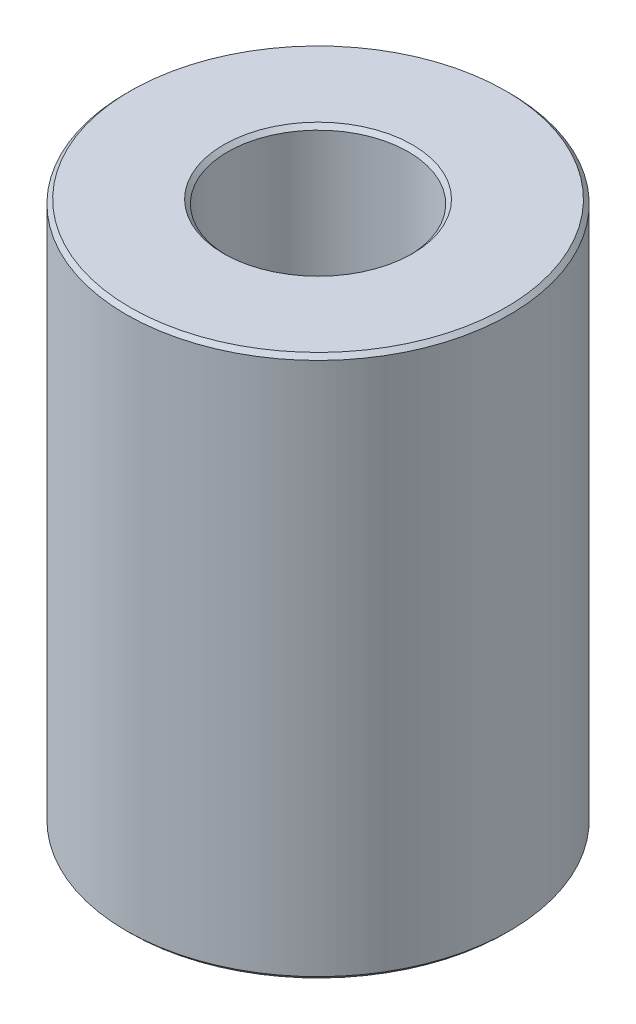
ISO-10303-21;
HEADER;
FILE_DESCRIPTION(('STEP AP214'),'2;1');
FILE_NAME('part.step','',(''),(''),'','','');
FILE_SCHEMA(('AUTOMOTIVE_DESIGN { 1 0 10303 214 1 1 1 1 }'));
ENDSEC;
DATA;
#1=APPLICATION_CONTEXT('core data for automotive mechanical design processes');
#2=APPLICATION_PROTOCOL_DEFINITION('international standard','automotive_design',2000,#1);
#3=PRODUCT_CONTEXT('',#1,'mechanical');
#4=PRODUCT('Part','Part','',(#3));
#5=PRODUCT_RELATED_PRODUCT_CATEGORY('part','',(#4));
#6=PRODUCT_DEFINITION_FORMATION('','',#4);
#7=PRODUCT_DEFINITION_CONTEXT('part definition',#1,'design');
#8=PRODUCT_DEFINITION('design','',#6,#7);
#9=PRODUCT_DEFINITION_SHAPE('','',#8);
#10=(LENGTH_UNIT() NAMED_UNIT(*) SI_UNIT(.MILLI.,.METRE.));
#11=(NAMED_UNIT(*) PLANE_ANGLE_UNIT() SI_UNIT($,.RADIAN.));
#12=(NAMED_UNIT(*) SI_UNIT($,.STERADIAN.) SOLID_ANGLE_UNIT());
#13=UNCERTAINTY_MEASURE_WITH_UNIT(LENGTH_MEASURE(1.E-05),#10,'distance_accuracy_value','');
#14=(GEOMETRIC_REPRESENTATION_CONTEXT(3) GLOBAL_UNCERTAINTY_ASSIGNED_CONTEXT((#13)) GLOBAL_UNIT_ASSIGNED_CONTEXT((#10,
#11,#12)) REPRESENTATION_CONTEXT('',''));
#15=CARTESIAN_POINT('',(0.,0.,0.));
#16=DIRECTION('',(0.,0.,1.));
#17=DIRECTION('',(1.,0.,0.));
#18=AXIS2_PLACEMENT_3D('',#15,#16,#17);
#19=CARTESIAN_POINT('',(0.,35.3197142230565,0.));
#20=DIRECTION('',(0.,-1.,0.));
#21=DIRECTION('',(0.,0.,-1.));
#22=AXIS2_PLACEMENT_3D('',#19,#20,#21);
#23=CYLINDRICAL_SURFACE('',#22,12.5);
#24=CARTESIAN_POINT('',(0.,0.265261535173894,0.));
#25=DIRECTION('',(0.,1.,0.));
#26=DIRECTION('',(0.,0.,1.));
#27=AXIS2_PLACEMENT_3D('',#24,#25,#26);
#28=CIRCLE('',#27,12.5);
#29=CARTESIAN_POINT('',(0.,0.265261535173894,12.5));
#30=VERTEX_POINT('',#29);
#31=EDGE_CURVE('E10',#30,#30,#28,.T.);
#32=ORIENTED_EDGE('',*,*,#31,.T.);
#33=EDGE_LOOP('',(#32));
#34=FACE_BOUND('',#33,.T.);
#35=CARTESIAN_POINT('',(0.,35.0544526878826,0.));
#36=DIRECTION('',(0.,1.,0.));
#37=DIRECTION('',(0.,0.,1.));
#38=AXIS2_PLACEMENT_3D('',#35,#36,#37);
#39=CIRCLE('',#38,12.5);
#40=CARTESIAN_POINT('',(0.,35.0544526878826,12.5));
#41=VERTEX_POINT('',#40);
#42=EDGE_CURVE('E50',#41,#41,#39,.F.);
#43=ORIENTED_EDGE('',*,*,#42,.T.);
#44=EDGE_LOOP('',(#43));
#45=FACE_BOUND('',#44,.T.);
#46=ADVANCED_FACE('F39',(#34,#45),#23,.T.);
#47=CARTESIAN_POINT('',(0.,35.3197142230565,0.));
#48=DIRECTION('',(0.,1.,0.));
#49=DIRECTION('',(0.,0.,1.));
#50=AXIS2_PLACEMENT_3D('',#47,#48,#49);
#51=PLANE('',#50);
#52=CARTESIAN_POINT('',(0.,35.3197142230565,0.));
#53=DIRECTION('',(0.,1.,0.));
#54=DIRECTION('',(0.,0.,1.));
#55=AXIS2_PLACEMENT_3D('',#52,#53,#54);
#56=CIRCLE('',#55,6.15316030806824);
#57=CARTESIAN_POINT('',(0.,35.3197142230565,6.15316030806824));
#58=VERTEX_POINT('',#57);
#59=EDGE_CURVE('E58',#58,#58,#56,.F.);
#60=ORIENTED_EDGE('',*,*,#59,.T.);
#61=EDGE_LOOP('',(#60));
#62=FACE_BOUND('',#61,.T.);
#63=CARTESIAN_POINT('',(0.,35.3197142230565,0.));
#64=DIRECTION('',(0.,1.,0.));
#65=DIRECTION('',(0.,0.,1.));
#66=AXIS2_PLACEMENT_3D('',#63,#64,#65);
#67=CIRCLE('',#66,12.2347384648261);
#68=CARTESIAN_POINT('',(0.,35.3197142230565,12.2347384648261));
#69=VERTEX_POINT('',#68);
#70=EDGE_CURVE('E61',#69,#69,#67,.T.);
#71=ORIENTED_EDGE('',*,*,#70,.T.);
#72=EDGE_LOOP('',(#71));
#73=FACE_BOUND('',#72,.T.);
#74=ADVANCED_FACE('F88',(#62,#73),#51,.T.);
#75=CARTESIAN_POINT('',(0.,0.,0.));
#76=DIRECTION('',(0.,1.,0.));
#77=DIRECTION('',(0.,0.,1.));
#78=AXIS2_PLACEMENT_3D('',#75,#76,#77);
#79=PLANE('',#78);
#80=CARTESIAN_POINT('',(0.,0.,0.));
#81=DIRECTION('',(0.,1.,0.));
#82=DIRECTION('',(0.,0.,1.));
#83=AXIS2_PLACEMENT_3D('',#80,#81,#82);
#84=CIRCLE('',#83,6.15316030806823);
#85=CARTESIAN_POINT('',(0.,0.,6.15316030806823));
#86=VERTEX_POINT('',#85);
#87=EDGE_CURVE('E51',#86,#86,#84,.T.);
#88=ORIENTED_EDGE('',*,*,#87,.T.);
#89=EDGE_LOOP('',(#88));
#90=FACE_BOUND('',#89,.T.);
#91=CARTESIAN_POINT('',(0.,0.,0.));
#92=DIRECTION('',(0.,1.,0.));
#93=DIRECTION('',(0.,0.,1.));
#94=AXIS2_PLACEMENT_3D('',#91,#92,#93);
#95=CIRCLE('',#94,12.2347384648261);
#96=CARTESIAN_POINT('',(0.,0.,12.2347384648261));
#97=VERTEX_POINT('',#96);
#98=EDGE_CURVE('E54',#97,#97,#95,.F.);
#99=ORIENTED_EDGE('',*,*,#98,.T.);
#100=EDGE_LOOP('',(#99));
#101=FACE_BOUND('',#100,.T.);
#102=ADVANCED_FACE('F83',(#90,#101),#79,.F.);
#103=CARTESIAN_POINT('',(0.,35.3197142230565,0.));
#104=DIRECTION('',(0.,-1.,0.));
#105=DIRECTION('',(0.,0.,-1.));
#106=AXIS2_PLACEMENT_3D('',#103,#104,#105);
#107=CYLINDRICAL_SURFACE('',#106,5.88789877289435);
#108=CARTESIAN_POINT('',(0.,35.0544526878826,0.));
#109=DIRECTION('',(0.,1.,0.));
#110=DIRECTION('',(0.,0.,1.));
#111=AXIS2_PLACEMENT_3D('',#108,#109,#110);
#112=CIRCLE('',#111,5.88789877289435);
#113=CARTESIAN_POINT('',(0.,35.0544526878826,5.88789877289435));
#114=VERTEX_POINT('',#113);
#115=EDGE_CURVE('E67',#114,#114,#112,.T.);
#116=ORIENTED_EDGE('',*,*,#115,.T.);
#117=EDGE_LOOP('',(#116));
#118=FACE_BOUND('',#117,.T.);
#119=CARTESIAN_POINT('',(0.,0.265261535173887,0.));
#120=DIRECTION('',(0.,1.,0.));
#121=DIRECTION('',(0.,0.,1.));
#122=AXIS2_PLACEMENT_3D('',#119,#120,#121);
#123=CIRCLE('',#122,5.88789877289435);
#124=CARTESIAN_POINT('',(0.,0.265261535173887,5.88789877289435));
#125=VERTEX_POINT('',#124);
#126=EDGE_CURVE('E69',#125,#125,#123,.F.);
#127=ORIENTED_EDGE('',*,*,#126,.T.);
#128=EDGE_LOOP('',(#127));
#129=FACE_BOUND('',#128,.T.);
#130=ADVANCED_FACE('F71',(#118,#129),#107,.F.);
#131=CARTESIAN_POINT('',(0.,35.0544526878826,0.));
#132=DIRECTION('',(0.,1.,0.));
#133=DIRECTION('',(0.,0.,1.));
#134=AXIS2_PLACEMENT_3D('',#131,#132,#133);
#135=CONICAL_SURFACE('',#134,5.88789877289435,0.785398163397448);
#136=ORIENTED_EDGE('',*,*,#59,.F.);
#137=EDGE_LOOP('',(#136));
#138=FACE_BOUND('',#137,.T.);
#139=ORIENTED_EDGE('',*,*,#115,.F.);
#140=EDGE_LOOP('',(#139));
#141=FACE_BOUND('',#140,.T.);
#142=ADVANCED_FACE('F77',(#138,#141),#135,.F.);
#143=CARTESIAN_POINT('',(0.,0.,0.));
#144=DIRECTION('',(0.,-1.,0.));
#145=DIRECTION('',(0.,0.,-1.));
#146=AXIS2_PLACEMENT_3D('',#143,#144,#145);
#147=CONICAL_SURFACE('',#146,6.15316030806823,0.785398163397442);
#148=ORIENTED_EDGE('',*,*,#126,.F.);
#149=EDGE_LOOP('',(#148));
#150=FACE_BOUND('',#149,.T.);
#151=ORIENTED_EDGE('',*,*,#87,.F.);
#152=EDGE_LOOP('',(#151));
#153=FACE_BOUND('',#152,.T.);
#154=ADVANCED_FACE('F73',(#150,#153),#147,.F.);
#155=CARTESIAN_POINT('',(0.,0.265261535173894,0.));
#156=DIRECTION('',(0.,1.,0.));
#157=DIRECTION('',(0.,0.,1.));
#158=AXIS2_PLACEMENT_3D('',#155,#156,#157);
#159=CONICAL_SURFACE('',#158,12.5,0.785398163397458);
#160=ORIENTED_EDGE('',*,*,#98,.F.);
#161=EDGE_LOOP('',(#160));
#162=FACE_BOUND('',#161,.T.);
#163=ORIENTED_EDGE('',*,*,#31,.F.);
#164=EDGE_LOOP('',(#163));
#165=FACE_BOUND('',#164,.T.);
#166=ADVANCED_FACE('F76',(#162,#165),#159,.T.);
#167=CARTESIAN_POINT('',(0.,35.3197142230565,0.));
#168=DIRECTION('',(0.,-1.,0.));
#169=DIRECTION('',(0.,0.,-1.));
#170=AXIS2_PLACEMENT_3D('',#167,#168,#169);
#171=CONICAL_SURFACE('',#170,12.2347384648261,0.785398163397445);
#172=ORIENTED_EDGE('',*,*,#42,.F.);
#173=EDGE_LOOP('',(#172));
#174=FACE_BOUND('',#173,.T.);
#175=ORIENTED_EDGE('',*,*,#70,.F.);
#176=EDGE_LOOP('',(#175));
#177=FACE_BOUND('',#176,.T.);
#178=ADVANCED_FACE('F45',(#174,#177),#171,.T.);
#179=CLOSED_SHELL('',(#46,#74,#102,#130,#142,#154,#166,#178));
#180=MANIFOLD_SOLID_BREP('B2',#179);
#181=ADVANCED_BREP_SHAPE_REPRESENTATION('',(#18,#180),#14);
#182=SHAPE_DEFINITION_REPRESENTATION(#9,#181);
ENDSEC;
END-ISO-10303-21;
